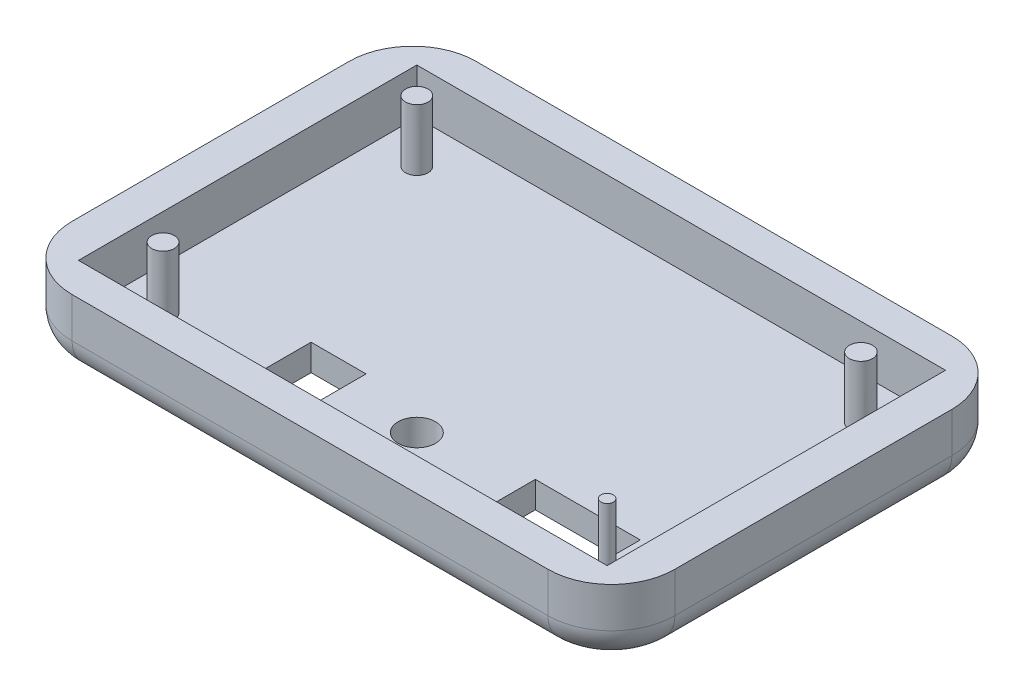
ISO-10303-21;
HEADER;
FILE_DESCRIPTION(('STEP AP214'),'2;1');
FILE_NAME('part.step','',(''),(''),'','','');
FILE_SCHEMA(('AUTOMOTIVE_DESIGN { 1 0 10303 214 1 1 1 1 }'));
ENDSEC;
DATA;
#1=APPLICATION_CONTEXT('core data for automotive mechanical design processes');
#2=APPLICATION_PROTOCOL_DEFINITION('international standard','automotive_design',2000,#1);
#3=PRODUCT_CONTEXT('',#1,'mechanical');
#4=PRODUCT('Part','Part','',(#3));
#5=PRODUCT_RELATED_PRODUCT_CATEGORY('part','',(#4));
#6=PRODUCT_DEFINITION_FORMATION('','',#4);
#7=PRODUCT_DEFINITION_CONTEXT('part definition',#1,'design');
#8=PRODUCT_DEFINITION('design','',#6,#7);
#9=PRODUCT_DEFINITION_SHAPE('','',#8);
#10=(LENGTH_UNIT() NAMED_UNIT(*) SI_UNIT(.MILLI.,.METRE.));
#11=(NAMED_UNIT(*) PLANE_ANGLE_UNIT() SI_UNIT($,.RADIAN.));
#12=(NAMED_UNIT(*) SI_UNIT($,.STERADIAN.) SOLID_ANGLE_UNIT());
#13=UNCERTAINTY_MEASURE_WITH_UNIT(LENGTH_MEASURE(1.E-05),#10,'distance_accuracy_value','');
#14=(GEOMETRIC_REPRESENTATION_CONTEXT(3) GLOBAL_UNCERTAINTY_ASSIGNED_CONTEXT((#13)) GLOBAL_UNIT_ASSIGNED_CONTEXT((#10,
#11,#12)) REPRESENTATION_CONTEXT('',''));
#15=CARTESIAN_POINT('',(0.,0.,0.));
#16=DIRECTION('',(0.,0.,1.));
#17=DIRECTION('',(1.,0.,0.));
#18=AXIS2_PLACEMENT_3D('',#15,#16,#17);
#19=CARTESIAN_POINT('',(0.,8.636,0.));
#20=DIRECTION('',(1.,0.,0.));
#21=DIRECTION('',(0.,0.,-1.));
#22=AXIS2_PLACEMENT_3D('',#19,#20,#21);
#23=PLANE('',#22);
#24=DIRECTION('',(0.,-1.,0.));
#25=VECTOR('',#24,1.);
#26=CARTESIAN_POINT('',(0.,8.636,-40.894));
#27=LINE('',#26,#25);
#28=CARTESIAN_POINT('',(0.,8.636,-40.894));
#29=VERTEX_POINT('',#28);
#30=CARTESIAN_POINT('',(0.,3.81,-40.894));
#31=VERTEX_POINT('',#30);
#32=EDGE_CURVE('E339',#29,#31,#27,.T.);
#33=ORIENTED_EDGE('',*,*,#32,.T.);
#34=DIRECTION('',(0.,0.,1.));
#35=VECTOR('',#34,1.);
#36=CARTESIAN_POINT('',(0.,3.81,-7.62));
#37=LINE('',#36,#35);
#38=CARTESIAN_POINT('',(0.,3.81,-7.62));
#39=VERTEX_POINT('',#38);
#40=EDGE_CURVE('E372',#31,#39,#37,.T.);
#41=ORIENTED_EDGE('',*,*,#40,.T.);
#42=DIRECTION('',(0.,-1.,0.));
#43=VECTOR('',#42,1.);
#44=CARTESIAN_POINT('',(0.,8.636,-7.62));
#45=LINE('',#44,#43);
#46=CARTESIAN_POINT('',(0.,8.636,-7.62));
#47=VERTEX_POINT('',#46);
#48=EDGE_CURVE('E342',#39,#47,#45,.F.);
#49=ORIENTED_EDGE('',*,*,#48,.T.);
#50=DIRECTION('',(0.,0.,1.));
#51=VECTOR('',#50,1.);
#52=CARTESIAN_POINT('',(0.,8.636,0.));
#53=LINE('',#52,#51);
#54=EDGE_CURVE('E298',#29,#47,#53,.T.);
#55=ORIENTED_EDGE('',*,*,#54,.F.);
#56=EDGE_LOOP('',(#33,#41,#49,#55));
#57=FACE_BOUND('',#56,.T.);
#58=ADVANCED_FACE('F37',(#57),#23,.F.);
#59=CARTESIAN_POINT('',(0.,8.636,0.));
#60=DIRECTION('',(0.,0.,-1.));
#61=DIRECTION('',(-1.,0.,0.));
#62=AXIS2_PLACEMENT_3D('',#59,#60,#61);
#63=PLANE('',#62);
#64=DIRECTION('',(0.,-1.,0.));
#65=VECTOR('',#64,1.);
#66=CARTESIAN_POINT('',(7.62,8.636,0.));
#67=LINE('',#66,#65);
#68=CARTESIAN_POINT('',(7.62,8.636,0.));
#69=VERTEX_POINT('',#68);
#70=CARTESIAN_POINT('',(7.62,3.81,0.));
#71=VERTEX_POINT('',#70);
#72=EDGE_CURVE('E334',#69,#71,#67,.T.);
#73=ORIENTED_EDGE('',*,*,#72,.T.);
#74=DIRECTION('',(1.,0.,0.));
#75=VECTOR('',#74,1.);
#76=CARTESIAN_POINT('',(64.77,3.81,0.));
#77=LINE('',#76,#75);
#78=CARTESIAN_POINT('',(64.77,3.81,0.));
#79=VERTEX_POINT('',#78);
#80=EDGE_CURVE('E368',#71,#79,#77,.T.);
#81=ORIENTED_EDGE('',*,*,#80,.T.);
#82=DIRECTION('',(0.,-1.,0.));
#83=VECTOR('',#82,1.);
#84=CARTESIAN_POINT('',(64.77,8.636,0.));
#85=LINE('',#84,#83);
#86=CARTESIAN_POINT('',(64.77,8.636,0.));
#87=VERTEX_POINT('',#86);
#88=EDGE_CURVE('E337',#79,#87,#85,.F.);
#89=ORIENTED_EDGE('',*,*,#88,.T.);
#90=DIRECTION('',(1.,0.,0.));
#91=VECTOR('',#90,1.);
#92=CARTESIAN_POINT('',(0.,8.636,0.));
#93=LINE('',#92,#91);
#94=EDGE_CURVE('E307',#69,#87,#93,.T.);
#95=ORIENTED_EDGE('',*,*,#94,.F.);
#96=EDGE_LOOP('',(#73,#81,#89,#95));
#97=FACE_BOUND('',#96,.T.);
#98=ADVANCED_FACE('F434',(#97),#63,.F.);
#99=CARTESIAN_POINT('',(72.39,8.636,0.));
#100=DIRECTION('',(-1.,0.,0.));
#101=DIRECTION('',(0.,0.,1.));
#102=AXIS2_PLACEMENT_3D('',#99,#100,#101);
#103=PLANE('',#102);
#104=DIRECTION('',(0.,-1.,0.));
#105=VECTOR('',#104,1.);
#106=CARTESIAN_POINT('',(72.39,8.636,-7.62));
#107=LINE('',#106,#105);
#108=CARTESIAN_POINT('',(72.39,8.636,-7.62));
#109=VERTEX_POINT('',#108);
#110=CARTESIAN_POINT('',(72.39,3.81,-7.62));
#111=VERTEX_POINT('',#110);
#112=EDGE_CURVE('E321',#109,#111,#107,.T.);
#113=ORIENTED_EDGE('',*,*,#112,.T.);
#114=DIRECTION('',(0.,0.,-1.));
#115=VECTOR('',#114,1.);
#116=CARTESIAN_POINT('',(72.39,3.81,-40.894));
#117=LINE('',#116,#115);
#118=CARTESIAN_POINT('',(72.39,3.81,-40.894));
#119=VERTEX_POINT('',#118);
#120=EDGE_CURVE('E364',#111,#119,#117,.T.);
#121=ORIENTED_EDGE('',*,*,#120,.T.);
#122=DIRECTION('',(0.,-1.,0.));
#123=VECTOR('',#122,1.);
#124=CARTESIAN_POINT('',(72.39,8.636,-40.894));
#125=LINE('',#124,#123);
#126=CARTESIAN_POINT('',(72.39,8.636,-40.894));
#127=VERTEX_POINT('',#126);
#128=EDGE_CURVE('E324',#119,#127,#125,.F.);
#129=ORIENTED_EDGE('',*,*,#128,.T.);
#130=DIRECTION('',(0.,0.,-1.));
#131=VECTOR('',#130,1.);
#132=CARTESIAN_POINT('',(72.39,8.636,0.));
#133=LINE('',#132,#131);
#134=EDGE_CURVE('E310',#109,#127,#133,.T.);
#135=ORIENTED_EDGE('',*,*,#134,.F.);
#136=EDGE_LOOP('',(#113,#121,#129,#135));
#137=FACE_BOUND('',#136,.T.);
#138=ADVANCED_FACE('F440',(#137),#103,.F.);
#139=CARTESIAN_POINT('',(0.,8.636,-48.514));
#140=DIRECTION('',(0.,0.,1.));
#141=DIRECTION('',(1.,0.,0.));
#142=AXIS2_PLACEMENT_3D('',#139,#140,#141);
#143=PLANE('',#142);
#144=DIRECTION('',(0.,-1.,0.));
#145=VECTOR('',#144,1.);
#146=CARTESIAN_POINT('',(64.77,8.636,-48.514));
#147=LINE('',#146,#145);
#148=CARTESIAN_POINT('',(64.77,8.636,-48.514));
#149=VERTEX_POINT('',#148);
#150=CARTESIAN_POINT('',(64.77,3.81,-48.514));
#151=VERTEX_POINT('',#150);
#152=EDGE_CURVE('E318',#149,#151,#147,.T.);
#153=ORIENTED_EDGE('',*,*,#152,.T.);
#154=DIRECTION('',(-1.,0.,0.));
#155=VECTOR('',#154,1.);
#156=CARTESIAN_POINT('',(7.62,3.81,-48.514));
#157=LINE('',#156,#155);
#158=CARTESIAN_POINT('',(7.62,3.81,-48.514));
#159=VERTEX_POINT('',#158);
#160=EDGE_CURVE('E376',#151,#159,#157,.T.);
#161=ORIENTED_EDGE('',*,*,#160,.T.);
#162=DIRECTION('',(0.,-1.,0.));
#163=VECTOR('',#162,1.);
#164=CARTESIAN_POINT('',(7.62,8.636,-48.514));
#165=LINE('',#164,#163);
#166=CARTESIAN_POINT('',(7.62,8.636,-48.514));
#167=VERTEX_POINT('',#166);
#168=EDGE_CURVE('E316',#159,#167,#165,.F.);
#169=ORIENTED_EDGE('',*,*,#168,.T.);
#170=DIRECTION('',(-1.,0.,0.));
#171=VECTOR('',#170,1.);
#172=CARTESIAN_POINT('',(0.,8.636,-48.514));
#173=LINE('',#172,#171);
#174=EDGE_CURVE('E313',#149,#167,#173,.T.);
#175=ORIENTED_EDGE('',*,*,#174,.F.);
#176=EDGE_LOOP('',(#153,#161,#169,#175));
#177=FACE_BOUND('',#176,.T.);
#178=ADVANCED_FACE('F526',(#177),#143,.F.);
#179=CARTESIAN_POINT('',(0.,8.636,0.));
#180=DIRECTION('',(0.,-1.,0.));
#181=DIRECTION('',(0.,0.,-1.));
#182=AXIS2_PLACEMENT_3D('',#179,#180,#181);
#183=PLANE('',#182);
#184=DIRECTION('',(-1.,0.,0.));
#185=VECTOR('',#184,1.);
#186=CARTESIAN_POINT('',(4.44499999999999,8.636,-44.577));
#187=LINE('',#186,#185);
#188=CARTESIAN_POINT('',(67.945,8.636,-44.577));
#189=VERTEX_POINT('',#188);
#190=CARTESIAN_POINT('',(4.44499999999999,8.636,-44.577));
#191=VERTEX_POINT('',#190);
#192=EDGE_CURVE('E286',#189,#191,#187,.T.);
#193=ORIENTED_EDGE('',*,*,#192,.F.);
#194=DIRECTION('',(0.,0.,-1.));
#195=VECTOR('',#194,1.);
#196=CARTESIAN_POINT('',(67.945,8.636,-3.937));
#197=LINE('',#196,#195);
#198=CARTESIAN_POINT('',(67.945,8.636,-3.937));
#199=VERTEX_POINT('',#198);
#200=EDGE_CURVE('E284',#199,#189,#197,.T.);
#201=ORIENTED_EDGE('',*,*,#200,.F.);
#202=DIRECTION('',(1.,0.,0.));
#203=VECTOR('',#202,1.);
#204=CARTESIAN_POINT('',(4.44499999999999,8.636,-3.937));
#205=LINE('',#204,#203);
#206=CARTESIAN_POINT('',(4.44499999999999,8.636,-3.937));
#207=VERTEX_POINT('',#206);
#208=EDGE_CURVE('E274',#207,#199,#205,.T.);
#209=ORIENTED_EDGE('',*,*,#208,.F.);
#210=DIRECTION('',(0.,0.,1.));
#211=VECTOR('',#210,1.);
#212=CARTESIAN_POINT('',(4.44499999999999,8.636,-3.937));
#213=LINE('',#212,#211);
#214=EDGE_CURVE('E291',#191,#207,#213,.T.);
#215=ORIENTED_EDGE('',*,*,#214,.F.);
#216=EDGE_LOOP('',(#193,#201,#209,#215));
#217=FACE_BOUND('',#216,.T.);
#218=ORIENTED_EDGE('',*,*,#134,.T.);
#219=CARTESIAN_POINT('',(64.77,8.636,-40.894));
#220=DIRECTION('',(0.,-1.,0.));
#221=DIRECTION('',(0.,0.,-1.));
#222=AXIS2_PLACEMENT_3D('',#219,#220,#221);
#223=CIRCLE('',#222,7.62);
#224=EDGE_CURVE('E332',#127,#149,#223,.F.);
#225=ORIENTED_EDGE('',*,*,#224,.T.);
#226=ORIENTED_EDGE('',*,*,#174,.T.);
#227=CARTESIAN_POINT('',(7.62,8.636,-40.894));
#228=DIRECTION('',(0.,-1.,0.));
#229=DIRECTION('',(0.,0.,-1.));
#230=AXIS2_PLACEMENT_3D('',#227,#228,#229);
#231=CIRCLE('',#230,7.62);
#232=EDGE_CURVE('E326',#167,#29,#231,.F.);
#233=ORIENTED_EDGE('',*,*,#232,.T.);
#234=ORIENTED_EDGE('',*,*,#54,.T.);
#235=CARTESIAN_POINT('',(7.62,8.636,-7.62));
#236=DIRECTION('',(0.,-1.,0.));
#237=DIRECTION('',(0.,0.,-1.));
#238=AXIS2_PLACEMENT_3D('',#235,#236,#237);
#239=CIRCLE('',#238,7.62);
#240=EDGE_CURVE('E328',#47,#69,#239,.F.);
#241=ORIENTED_EDGE('',*,*,#240,.T.);
#242=ORIENTED_EDGE('',*,*,#94,.T.);
#243=CARTESIAN_POINT('',(64.77,8.636,-7.62));
#244=DIRECTION('',(0.,-1.,0.));
#245=DIRECTION('',(0.,0.,-1.));
#246=AXIS2_PLACEMENT_3D('',#243,#244,#245);
#247=CIRCLE('',#246,7.62);
#248=EDGE_CURVE('E330',#87,#109,#247,.F.);
#249=ORIENTED_EDGE('',*,*,#248,.T.);
#250=EDGE_LOOP('',(#218,#225,#226,#233,#234,#241,#242,#249));
#251=FACE_BOUND('',#250,.T.);
#252=ADVANCED_FACE('F506',(#217,#251),#183,.F.);
#253=CARTESIAN_POINT('',(0.,0.,0.));
#254=DIRECTION('',(0.,-1.,0.));
#255=DIRECTION('',(0.,0.,-1.));
#256=AXIS2_PLACEMENT_3D('',#253,#254,#255);
#257=PLANE('',#256);
#258=DIRECTION('',(0.,0.,-1.));
#259=VECTOR('',#258,1.);
#260=CARTESIAN_POINT('',(49.199,0.,0.));
#261=LINE('',#260,#259);
#262=CARTESIAN_POINT('',(49.199,0.,-9.05699999999999));
#263=VERTEX_POINT('',#262);
#264=CARTESIAN_POINT('',(49.199,0.,-14.057));
#265=VERTEX_POINT('',#264);
#266=EDGE_CURVE('E261',#263,#265,#261,.T.);
#267=ORIENTED_EDGE('',*,*,#266,.F.);
#268=DIRECTION('',(-1.,0.,0.));
#269=VECTOR('',#268,1.);
#270=CARTESIAN_POINT('',(0.,0.,-9.05699999999999));
#271=LINE('',#270,#269);
#272=CARTESIAN_POINT('',(61.799,0.,-9.057));
#273=VERTEX_POINT('',#272);
#274=EDGE_CURVE('E256',#273,#263,#271,.T.);
#275=ORIENTED_EDGE('',*,*,#274,.F.);
#276=DIRECTION('',(0.,0.,1.));
#277=VECTOR('',#276,1.);
#278=CARTESIAN_POINT('',(61.799,0.,0.));
#279=LINE('',#278,#277);
#280=CARTESIAN_POINT('',(61.799,0.,-14.057));
#281=VERTEX_POINT('',#280);
#282=EDGE_CURVE('E203',#281,#273,#279,.T.);
#283=ORIENTED_EDGE('',*,*,#282,.F.);
#284=DIRECTION('',(1.,0.,0.));
#285=VECTOR('',#284,1.);
#286=CARTESIAN_POINT('',(0.,0.,-14.057));
#287=LINE('',#286,#285);
#288=EDGE_CURVE('E259',#265,#281,#287,.T.);
#289=ORIENTED_EDGE('',*,*,#288,.F.);
#290=EDGE_LOOP('',(#267,#275,#283,#289));
#291=FACE_BOUND('',#290,.T.);
#292=DIRECTION('',(0.,0.,-1.));
#293=VECTOR('',#292,1.);
#294=CARTESIAN_POINT('',(21.463,0.,0.));
#295=LINE('',#294,#293);
#296=CARTESIAN_POINT('',(21.463,0.,-8.25499999999999));
#297=VERTEX_POINT('',#296);
#298=CARTESIAN_POINT('',(21.463,0.,-14.859));
#299=VERTEX_POINT('',#298);
#300=EDGE_CURVE('E254',#297,#299,#295,.T.);
#301=ORIENTED_EDGE('',*,*,#300,.F.);
#302=DIRECTION('',(-1.,0.,0.));
#303=VECTOR('',#302,1.);
#304=CARTESIAN_POINT('',(0.,0.,-8.25499999999999));
#305=LINE('',#304,#303);
#306=CARTESIAN_POINT('',(28.067,0.,-8.255));
#307=VERTEX_POINT('',#306);
#308=EDGE_CURVE('E227',#307,#297,#305,.T.);
#309=ORIENTED_EDGE('',*,*,#308,.F.);
#310=DIRECTION('',(0.,0.,1.));
#311=VECTOR('',#310,1.);
#312=CARTESIAN_POINT('',(28.067,0.,0.));
#313=LINE('',#312,#311);
#314=CARTESIAN_POINT('',(28.067,0.,-14.859));
#315=VERTEX_POINT('',#314);
#316=EDGE_CURVE('E250',#315,#307,#313,.T.);
#317=ORIENTED_EDGE('',*,*,#316,.F.);
#318=DIRECTION('',(1.,0.,0.));
#319=VECTOR('',#318,1.);
#320=CARTESIAN_POINT('',(0.,0.,-14.859));
#321=LINE('',#320,#319);
#322=EDGE_CURVE('E252',#299,#315,#321,.T.);
#323=ORIENTED_EDGE('',*,*,#322,.F.);
#324=EDGE_LOOP('',(#301,#309,#317,#323));
#325=FACE_BOUND('',#324,.T.);
#326=CARTESIAN_POINT('',(37.211,0.,-11.811));
#327=DIRECTION('',(0.,-1.,0.));
#328=DIRECTION('',(0.,0.,-1.));
#329=AXIS2_PLACEMENT_3D('',#326,#327,#328);
#330=CIRCLE('',#329,2.25);
#331=CARTESIAN_POINT('',(37.211,0.,-14.061));
#332=VERTEX_POINT('',#331);
#333=EDGE_CURVE('E266',#332,#332,#330,.T.);
#334=ORIENTED_EDGE('',*,*,#333,.F.);
#335=EDGE_LOOP('',(#334));
#336=FACE_BOUND('',#335,.T.);
#337=DIRECTION('',(-1.,0.,0.));
#338=VECTOR('',#337,1.);
#339=CARTESIAN_POINT('',(64.77,0.,-44.704));
#340=LINE('',#339,#338);
#341=CARTESIAN_POINT('',(7.62,0.,-44.704));
#342=VERTEX_POINT('',#341);
#343=CARTESIAN_POINT('',(64.77,0.,-44.704));
#344=VERTEX_POINT('',#343);
#345=EDGE_CURVE('E344',#342,#344,#340,.F.);
#346=ORIENTED_EDGE('',*,*,#345,.T.);
#347=CARTESIAN_POINT('',(64.77,0.,-40.894));
#348=DIRECTION('',(0.,-1.,0.));
#349=DIRECTION('',(0.,0.,-1.));
#350=AXIS2_PLACEMENT_3D('',#347,#348,#349);
#351=CIRCLE('',#350,3.81);
#352=CARTESIAN_POINT('',(68.58,0.,-40.894));
#353=VERTEX_POINT('',#352);
#354=EDGE_CURVE('E358',#344,#353,#351,.T.);
#355=ORIENTED_EDGE('',*,*,#354,.T.);
#356=DIRECTION('',(0.,0.,-1.));
#357=VECTOR('',#356,1.);
#358=CARTESIAN_POINT('',(68.58,0.,-7.62));
#359=LINE('',#358,#357);
#360=CARTESIAN_POINT('',(68.58,0.,-7.62));
#361=VERTEX_POINT('',#360);
#362=EDGE_CURVE('E356',#353,#361,#359,.F.);
#363=ORIENTED_EDGE('',*,*,#362,.T.);
#364=CARTESIAN_POINT('',(64.77,0.,-7.62));
#365=DIRECTION('',(0.,-1.,0.));
#366=DIRECTION('',(0.,0.,-1.));
#367=AXIS2_PLACEMENT_3D('',#364,#365,#366);
#368=CIRCLE('',#367,3.81);
#369=CARTESIAN_POINT('',(64.77,0.,-3.81));
#370=VERTEX_POINT('',#369);
#371=EDGE_CURVE('E354',#361,#370,#368,.T.);
#372=ORIENTED_EDGE('',*,*,#371,.T.);
#373=DIRECTION('',(1.,0.,0.));
#374=VECTOR('',#373,1.);
#375=CARTESIAN_POINT('',(7.62,0.,-3.81));
#376=LINE('',#375,#374);
#377=CARTESIAN_POINT('',(7.62,0.,-3.81));
#378=VERTEX_POINT('',#377);
#379=EDGE_CURVE('E352',#370,#378,#376,.F.);
#380=ORIENTED_EDGE('',*,*,#379,.T.);
#381=CARTESIAN_POINT('',(7.62,0.,-7.62));
#382=DIRECTION('',(0.,-1.,0.));
#383=DIRECTION('',(0.,0.,-1.));
#384=AXIS2_PLACEMENT_3D('',#381,#382,#383);
#385=CIRCLE('',#384,3.81);
#386=CARTESIAN_POINT('',(3.81,0.,-7.62));
#387=VERTEX_POINT('',#386);
#388=EDGE_CURVE('E350',#378,#387,#385,.T.);
#389=ORIENTED_EDGE('',*,*,#388,.T.);
#390=DIRECTION('',(0.,0.,1.));
#391=VECTOR('',#390,1.);
#392=CARTESIAN_POINT('',(3.81,0.,-40.894));
#393=LINE('',#392,#391);
#394=CARTESIAN_POINT('',(3.81,0.,-40.894));
#395=VERTEX_POINT('',#394);
#396=EDGE_CURVE('E348',#387,#395,#393,.F.);
#397=ORIENTED_EDGE('',*,*,#396,.T.);
#398=CARTESIAN_POINT('',(7.62,0.,-40.894));
#399=DIRECTION('',(0.,-1.,0.));
#400=DIRECTION('',(0.,0.,-1.));
#401=AXIS2_PLACEMENT_3D('',#398,#399,#400);
#402=CIRCLE('',#401,3.81);
#403=EDGE_CURVE('E346',#395,#342,#402,.T.);
#404=ORIENTED_EDGE('',*,*,#403,.T.);
#405=EDGE_LOOP('',(#346,#355,#363,#372,#380,#389,#397,#404));
#406=FACE_BOUND('',#405,.T.);
#407=ADVANCED_FACE('F536',(#291,#325,#336,#406),#257,.T.);
#408=CARTESIAN_POINT('',(67.945,3.175,-3.937));
#409=DIRECTION('',(1.,0.,0.));
#410=DIRECTION('',(0.,0.,-1.));
#411=AXIS2_PLACEMENT_3D('',#408,#409,#410);
#412=PLANE('',#411);
#413=ORIENTED_EDGE('',*,*,#200,.T.);
#414=DIRECTION('',(0.,1.,0.));
#415=VECTOR('',#414,1.);
#416=CARTESIAN_POINT('',(67.945,3.175,-44.577));
#417=LINE('',#416,#415);
#418=CARTESIAN_POINT('',(67.945,3.175,-44.577));
#419=VERTEX_POINT('',#418);
#420=EDGE_CURVE('E283',#419,#189,#417,.T.);
#421=ORIENTED_EDGE('',*,*,#420,.F.);
#422=DIRECTION('',(0.,0.,-1.));
#423=VECTOR('',#422,1.);
#424=CARTESIAN_POINT('',(67.945,3.175,-3.937));
#425=LINE('',#424,#423);
#426=CARTESIAN_POINT('',(67.945,3.175,-3.937));
#427=VERTEX_POINT('',#426);
#428=EDGE_CURVE('E270',#427,#419,#425,.T.);
#429=ORIENTED_EDGE('',*,*,#428,.F.);
#430=DIRECTION('',(0.,1.,0.));
#431=VECTOR('',#430,1.);
#432=CARTESIAN_POINT('',(67.945,3.175,-3.937));
#433=LINE('',#432,#431);
#434=EDGE_CURVE('E296',#427,#199,#433,.T.);
#435=ORIENTED_EDGE('',*,*,#434,.T.);
#436=EDGE_LOOP('',(#413,#421,#429,#435));
#437=FACE_BOUND('',#436,.T.);
#438=ADVANCED_FACE('F539',(#437),#412,.F.);
#439=CARTESIAN_POINT('',(4.44499999999999,3.175,-3.937));
#440=DIRECTION('',(0.,0.,1.));
#441=DIRECTION('',(1.,0.,0.));
#442=AXIS2_PLACEMENT_3D('',#439,#440,#441);
#443=PLANE('',#442);
#444=ORIENTED_EDGE('',*,*,#208,.T.);
#445=ORIENTED_EDGE('',*,*,#434,.F.);
#446=DIRECTION('',(1.,0.,0.));
#447=VECTOR('',#446,1.);
#448=CARTESIAN_POINT('',(4.44499999999999,3.175,-3.937));
#449=LINE('',#448,#447);
#450=CARTESIAN_POINT('',(4.44499999999999,3.175,-3.937));
#451=VERTEX_POINT('',#450);
#452=EDGE_CURVE('E280',#451,#427,#449,.T.);
#453=ORIENTED_EDGE('',*,*,#452,.F.);
#454=DIRECTION('',(0.,1.,0.));
#455=VECTOR('',#454,1.);
#456=CARTESIAN_POINT('',(4.44499999999999,3.175,-3.937));
#457=LINE('',#456,#455);
#458=EDGE_CURVE('E299',#451,#207,#457,.T.);
#459=ORIENTED_EDGE('',*,*,#458,.T.);
#460=EDGE_LOOP('',(#444,#445,#453,#459));
#461=FACE_BOUND('',#460,.T.);
#462=ADVANCED_FACE('F546',(#461),#443,.F.);
#463=CARTESIAN_POINT('',(4.44499999999999,3.175,-3.937));
#464=DIRECTION('',(-1.,0.,0.));
#465=DIRECTION('',(0.,0.,1.));
#466=AXIS2_PLACEMENT_3D('',#463,#464,#465);
#467=PLANE('',#466);
#468=ORIENTED_EDGE('',*,*,#214,.T.);
#469=ORIENTED_EDGE('',*,*,#458,.F.);
#470=DIRECTION('',(0.,0.,1.));
#471=VECTOR('',#470,1.);
#472=CARTESIAN_POINT('',(4.44499999999999,3.175,-3.937));
#473=LINE('',#472,#471);
#474=CARTESIAN_POINT('',(4.44499999999999,3.175,-44.577));
#475=VERTEX_POINT('',#474);
#476=EDGE_CURVE('E277',#475,#451,#473,.T.);
#477=ORIENTED_EDGE('',*,*,#476,.F.);
#478=DIRECTION('',(0.,1.,0.));
#479=VECTOR('',#478,1.);
#480=CARTESIAN_POINT('',(4.44499999999999,3.175,-44.577));
#481=LINE('',#480,#479);
#482=EDGE_CURVE('E301',#475,#191,#481,.T.);
#483=ORIENTED_EDGE('',*,*,#482,.T.);
#484=EDGE_LOOP('',(#468,#469,#477,#483));
#485=FACE_BOUND('',#484,.T.);
#486=ADVANCED_FACE('F591',(#485),#467,.F.);
#487=CARTESIAN_POINT('',(4.44499999999999,3.175,-44.577));
#488=DIRECTION('',(0.,0.,-1.));
#489=DIRECTION('',(-1.,0.,0.));
#490=AXIS2_PLACEMENT_3D('',#487,#488,#489);
#491=PLANE('',#490);
#492=ORIENTED_EDGE('',*,*,#192,.T.);
#493=ORIENTED_EDGE('',*,*,#482,.F.);
#494=DIRECTION('',(-1.,0.,0.));
#495=VECTOR('',#494,1.);
#496=CARTESIAN_POINT('',(4.44499999999999,3.175,-44.577));
#497=LINE('',#496,#495);
#498=EDGE_CURVE('E273',#419,#475,#497,.T.);
#499=ORIENTED_EDGE('',*,*,#498,.F.);
#500=ORIENTED_EDGE('',*,*,#420,.T.);
#501=EDGE_LOOP('',(#492,#493,#499,#500));
#502=FACE_BOUND('',#501,.T.);
#503=ADVANCED_FACE('F411',(#502),#491,.F.);
#504=CARTESIAN_POINT('',(0.,3.175,0.));
#505=DIRECTION('',(0.,-1.,0.));
#506=DIRECTION('',(0.,0.,-1.));
#507=AXIS2_PLACEMENT_3D('',#504,#505,#506);
#508=PLANE('',#507);
#509=CARTESIAN_POINT('',(62.865,3.175,-9.017));
#510=DIRECTION('',(0.,-1.,0.));
#511=DIRECTION('',(0.,0.,-1.));
#512=AXIS2_PLACEMENT_3D('',#509,#510,#511);
#513=CIRCLE('',#512,0.749999999999999);
#514=CARTESIAN_POINT('',(62.865,3.175,-9.767));
#515=VERTEX_POINT('',#514);
#516=EDGE_CURVE('E11',#515,#515,#513,.F.);
#517=ORIENTED_EDGE('',*,*,#516,.F.);
#518=EDGE_LOOP('',(#517));
#519=FACE_BOUND('',#518,.T.);
#520=CARTESIAN_POINT('',(62.865,3.175,-39.497));
#521=DIRECTION('',(0.,-1.,0.));
#522=DIRECTION('',(0.,0.,-1.));
#523=AXIS2_PLACEMENT_3D('',#520,#521,#522);
#524=CIRCLE('',#523,1.385);
#525=CARTESIAN_POINT('',(62.865,3.175,-40.882));
#526=VERTEX_POINT('',#525);
#527=EDGE_CURVE('E45',#526,#526,#524,.F.);
#528=ORIENTED_EDGE('',*,*,#527,.F.);
#529=EDGE_LOOP('',(#528));
#530=FACE_BOUND('',#529,.T.);
#531=CARTESIAN_POINT('',(9.52499999999999,3.175,-9.017));
#532=DIRECTION('',(0.,-1.,0.));
#533=DIRECTION('',(0.,0.,-1.));
#534=AXIS2_PLACEMENT_3D('',#531,#532,#533);
#535=CIRCLE('',#534,1.3499973);
#536=CARTESIAN_POINT('',(9.52499999999999,3.175,-10.3669973));
#537=VERTEX_POINT('',#536);
#538=EDGE_CURVE('E401',#537,#537,#535,.F.);
#539=ORIENTED_EDGE('',*,*,#538,.F.);
#540=EDGE_LOOP('',(#539));
#541=FACE_BOUND('',#540,.T.);
#542=CARTESIAN_POINT('',(9.52499999999999,3.175,-39.497));
#543=DIRECTION('',(0.,-1.,0.));
#544=DIRECTION('',(0.,0.,-1.));
#545=AXIS2_PLACEMENT_3D('',#542,#543,#544);
#546=CIRCLE('',#545,1.35);
#547=CARTESIAN_POINT('',(9.52499999999999,3.175,-40.847));
#548=VERTEX_POINT('',#547);
#549=EDGE_CURVE('E378',#548,#548,#546,.F.);
#550=ORIENTED_EDGE('',*,*,#549,.F.);
#551=EDGE_LOOP('',(#550));
#552=FACE_BOUND('',#551,.T.);
#553=DIRECTION('',(1.,0.,0.));
#554=VECTOR('',#553,1.);
#555=CARTESIAN_POINT('',(61.799,3.175,-9.057));
#556=LINE('',#555,#554);
#557=CARTESIAN_POINT('',(49.199,3.175,-9.05699999999999));
#558=VERTEX_POINT('',#557);
#559=CARTESIAN_POINT('',(61.799,3.175,-9.057));
#560=VERTEX_POINT('',#559);
#561=EDGE_CURVE('E210',#558,#560,#556,.T.);
#562=ORIENTED_EDGE('',*,*,#561,.F.);
#563=DIRECTION('',(0.,0.,1.));
#564=VECTOR('',#563,1.);
#565=CARTESIAN_POINT('',(49.199,3.175,-14.057));
#566=LINE('',#565,#564);
#567=CARTESIAN_POINT('',(49.199,3.175,-14.057));
#568=VERTEX_POINT('',#567);
#569=EDGE_CURVE('E215',#568,#558,#566,.T.);
#570=ORIENTED_EDGE('',*,*,#569,.F.);
#571=DIRECTION('',(-1.,0.,0.));
#572=VECTOR('',#571,1.);
#573=CARTESIAN_POINT('',(61.799,3.175,-14.057));
#574=LINE('',#573,#572);
#575=CARTESIAN_POINT('',(61.799,3.175,-14.057));
#576=VERTEX_POINT('',#575);
#577=EDGE_CURVE('E220',#576,#568,#574,.T.);
#578=ORIENTED_EDGE('',*,*,#577,.F.);
#579=DIRECTION('',(0.,0.,-1.));
#580=VECTOR('',#579,1.);
#581=CARTESIAN_POINT('',(61.799,3.175,-14.057));
#582=LINE('',#581,#580);
#583=EDGE_CURVE('E200',#560,#576,#582,.T.);
#584=ORIENTED_EDGE('',*,*,#583,.F.);
#585=EDGE_LOOP('',(#562,#570,#578,#584));
#586=FACE_BOUND('',#585,.T.);
#587=DIRECTION('',(1.,0.,0.));
#588=VECTOR('',#587,1.);
#589=CARTESIAN_POINT('',(28.067,3.175,-8.255));
#590=LINE('',#589,#588);
#591=CARTESIAN_POINT('',(21.463,3.175,-8.25499999999999));
#592=VERTEX_POINT('',#591);
#593=CARTESIAN_POINT('',(28.067,3.175,-8.255));
#594=VERTEX_POINT('',#593);
#595=EDGE_CURVE('E232',#592,#594,#590,.T.);
#596=ORIENTED_EDGE('',*,*,#595,.F.);
#597=DIRECTION('',(0.,0.,1.));
#598=VECTOR('',#597,1.);
#599=CARTESIAN_POINT('',(21.463,3.175,-14.859));
#600=LINE('',#599,#598);
#601=CARTESIAN_POINT('',(21.463,3.175,-14.859));
#602=VERTEX_POINT('',#601);
#603=EDGE_CURVE('E230',#602,#592,#600,.T.);
#604=ORIENTED_EDGE('',*,*,#603,.F.);
#605=DIRECTION('',(-1.,0.,0.));
#606=VECTOR('',#605,1.);
#607=CARTESIAN_POINT('',(28.067,3.175,-14.859));
#608=LINE('',#607,#606);
#609=CARTESIAN_POINT('',(28.067,3.175,-14.859));
#610=VERTEX_POINT('',#609);
#611=EDGE_CURVE('E238',#610,#602,#608,.T.);
#612=ORIENTED_EDGE('',*,*,#611,.F.);
#613=DIRECTION('',(0.,0.,-1.));
#614=VECTOR('',#613,1.);
#615=CARTESIAN_POINT('',(28.067,3.175,-14.859));
#616=LINE('',#615,#614);
#617=EDGE_CURVE('E235',#594,#610,#616,.T.);
#618=ORIENTED_EDGE('',*,*,#617,.F.);
#619=EDGE_LOOP('',(#596,#604,#612,#618));
#620=FACE_BOUND('',#619,.T.);
#621=CARTESIAN_POINT('',(37.211,3.175,-11.811));
#622=DIRECTION('',(0.,1.,0.));
#623=DIRECTION('',(0.,0.,1.));
#624=AXIS2_PLACEMENT_3D('',#621,#622,#623);
#625=CIRCLE('',#624,2.25);
#626=CARTESIAN_POINT('',(37.211,3.175,-9.56099999999999));
#627=VERTEX_POINT('',#626);
#628=EDGE_CURVE('E263',#627,#627,#625,.T.);
#629=ORIENTED_EDGE('',*,*,#628,.F.);
#630=EDGE_LOOP('',(#629));
#631=FACE_BOUND('',#630,.T.);
#632=ORIENTED_EDGE('',*,*,#428,.T.);
#633=ORIENTED_EDGE('',*,*,#498,.T.);
#634=ORIENTED_EDGE('',*,*,#476,.T.);
#635=ORIENTED_EDGE('',*,*,#452,.T.);
#636=EDGE_LOOP('',(#632,#633,#634,#635));
#637=FACE_BOUND('',#636,.T.);
#638=ADVANCED_FACE('F217',(#519,#530,#541,#552,#586,#620,#631,#637),#508,.F.);
#639=CARTESIAN_POINT('',(64.77,8.636,-40.894));
#640=DIRECTION('',(0.,-1.,0.));
#641=DIRECTION('',(0.,0.,-1.));
#642=AXIS2_PLACEMENT_3D('',#639,#640,#641);
#643=CYLINDRICAL_SURFACE('',#642,7.62);
#644=ORIENTED_EDGE('',*,*,#128,.F.);
#645=CARTESIAN_POINT('',(64.77,3.81,-40.894));
#646=DIRECTION('',(0.,-1.,0.));
#647=DIRECTION('',(0.,0.,-1.));
#648=AXIS2_PLACEMENT_3D('',#645,#646,#647);
#649=CIRCLE('',#648,7.62);
#650=EDGE_CURVE('E361',#119,#151,#649,.F.);
#651=ORIENTED_EDGE('',*,*,#650,.T.);
#652=ORIENTED_EDGE('',*,*,#152,.F.);
#653=ORIENTED_EDGE('',*,*,#224,.F.);
#654=EDGE_LOOP('',(#644,#651,#652,#653));
#655=FACE_BOUND('',#654,.T.);
#656=ADVANCED_FACE('F410',(#655),#643,.T.);
#657=CARTESIAN_POINT('',(64.77,8.636,-7.62));
#658=DIRECTION('',(0.,-1.,0.));
#659=DIRECTION('',(0.,0.,-1.));
#660=AXIS2_PLACEMENT_3D('',#657,#658,#659);
#661=CYLINDRICAL_SURFACE('',#660,7.62);
#662=ORIENTED_EDGE('',*,*,#88,.F.);
#663=CARTESIAN_POINT('',(64.77,3.81,-7.62));
#664=DIRECTION('',(0.,-1.,0.));
#665=DIRECTION('',(0.,0.,-1.));
#666=AXIS2_PLACEMENT_3D('',#663,#664,#665);
#667=CIRCLE('',#666,7.62);
#668=EDGE_CURVE('E366',#79,#111,#667,.F.);
#669=ORIENTED_EDGE('',*,*,#668,.T.);
#670=ORIENTED_EDGE('',*,*,#112,.F.);
#671=ORIENTED_EDGE('',*,*,#248,.F.);
#672=EDGE_LOOP('',(#662,#669,#670,#671));
#673=FACE_BOUND('',#672,.T.);
#674=ADVANCED_FACE('F447',(#673),#661,.T.);
#675=CARTESIAN_POINT('',(7.62,8.636,-7.62));
#676=DIRECTION('',(0.,-1.,0.));
#677=DIRECTION('',(0.,0.,-1.));
#678=AXIS2_PLACEMENT_3D('',#675,#676,#677);
#679=CYLINDRICAL_SURFACE('',#678,7.62);
#680=ORIENTED_EDGE('',*,*,#48,.F.);
#681=CARTESIAN_POINT('',(7.62,3.81,-7.62));
#682=DIRECTION('',(0.,-1.,0.));
#683=DIRECTION('',(0.,0.,-1.));
#684=AXIS2_PLACEMENT_3D('',#681,#682,#683);
#685=CIRCLE('',#684,7.62);
#686=EDGE_CURVE('E370',#39,#71,#685,.F.);
#687=ORIENTED_EDGE('',*,*,#686,.T.);
#688=ORIENTED_EDGE('',*,*,#72,.F.);
#689=ORIENTED_EDGE('',*,*,#240,.F.);
#690=EDGE_LOOP('',(#680,#687,#688,#689));
#691=FACE_BOUND('',#690,.T.);
#692=ADVANCED_FACE('F451',(#691),#679,.T.);
#693=CARTESIAN_POINT('',(7.62,8.636,-40.894));
#694=DIRECTION('',(0.,-1.,0.));
#695=DIRECTION('',(0.,0.,-1.));
#696=AXIS2_PLACEMENT_3D('',#693,#694,#695);
#697=CYLINDRICAL_SURFACE('',#696,7.62);
#698=ORIENTED_EDGE('',*,*,#168,.F.);
#699=CARTESIAN_POINT('',(7.62,3.81,-40.894));
#700=DIRECTION('',(0.,-1.,0.));
#701=DIRECTION('',(0.,0.,-1.));
#702=AXIS2_PLACEMENT_3D('',#699,#700,#701);
#703=CIRCLE('',#702,7.62);
#704=EDGE_CURVE('E374',#159,#31,#703,.F.);
#705=ORIENTED_EDGE('',*,*,#704,.T.);
#706=ORIENTED_EDGE('',*,*,#32,.F.);
#707=ORIENTED_EDGE('',*,*,#232,.F.);
#708=EDGE_LOOP('',(#698,#705,#706,#707));
#709=FACE_BOUND('',#708,.T.);
#710=ADVANCED_FACE('F455',(#709),#697,.T.);
#711=CARTESIAN_POINT('',(7.62,3.81,-7.62));
#712=DIRECTION('',(0.,-1.,0.));
#713=DIRECTION('',(0.,0.,-1.));
#714=AXIS2_PLACEMENT_3D('',#711,#712,#713);
#715=DEGENERATE_TOROIDAL_SURFACE('',#714,3.81,3.81,.T.);
#716=CARTESIAN_POINT('',(7.62,3.81,-3.81));
#717=DIRECTION('',(1.,0.,0.));
#718=DIRECTION('',(0.,0.,-1.));
#719=AXIS2_PLACEMENT_3D('',#716,#717,#718);
#720=CIRCLE('',#719,3.81);
#721=EDGE_CURVE('E394',#71,#378,#720,.T.);
#722=ORIENTED_EDGE('',*,*,#721,.F.);
#723=ORIENTED_EDGE('',*,*,#686,.F.);
#724=CARTESIAN_POINT('',(3.81,3.81,-7.62));
#725=DIRECTION('',(0.,0.,-1.));
#726=DIRECTION('',(-1.,0.,0.));
#727=AXIS2_PLACEMENT_3D('',#724,#725,#726);
#728=CIRCLE('',#727,3.81);
#729=EDGE_CURVE('E287',#387,#39,#728,.T.);
#730=ORIENTED_EDGE('',*,*,#729,.F.);
#731=ORIENTED_EDGE('',*,*,#388,.F.);
#732=EDGE_LOOP('',(#722,#723,#730,#731));
#733=FACE_BOUND('',#732,.T.);
#734=ADVANCED_FACE('F39',(#733),#715,.T.);
#735=CARTESIAN_POINT('',(3.81,3.81,0.));
#736=DIRECTION('',(0.,0.,-1.));
#737=DIRECTION('',(-1.,0.,0.));
#738=AXIS2_PLACEMENT_3D('',#735,#736,#737);
#739=CYLINDRICAL_SURFACE('',#738,3.81);
#740=ORIENTED_EDGE('',*,*,#729,.T.);
#741=ORIENTED_EDGE('',*,*,#40,.F.);
#742=CARTESIAN_POINT('',(3.81,3.81,-40.894));
#743=DIRECTION('',(0.,0.,-1.));
#744=DIRECTION('',(-1.,0.,0.));
#745=AXIS2_PLACEMENT_3D('',#742,#743,#744);
#746=CIRCLE('',#745,3.81);
#747=EDGE_CURVE('E391',#395,#31,#746,.T.);
#748=ORIENTED_EDGE('',*,*,#747,.F.);
#749=ORIENTED_EDGE('',*,*,#396,.F.);
#750=EDGE_LOOP('',(#740,#741,#748,#749));
#751=FACE_BOUND('',#750,.T.);
#752=ADVANCED_FACE('F483',(#751),#739,.T.);
#753=CARTESIAN_POINT('',(0.,3.81,-3.81));
#754=DIRECTION('',(-1.,0.,0.));
#755=DIRECTION('',(0.,0.,1.));
#756=AXIS2_PLACEMENT_3D('',#753,#754,#755);
#757=CYLINDRICAL_SURFACE('',#756,3.81);
#758=ORIENTED_EDGE('',*,*,#721,.T.);
#759=ORIENTED_EDGE('',*,*,#379,.F.);
#760=CARTESIAN_POINT('',(64.77,3.81,-3.81));
#761=DIRECTION('',(1.,0.,0.));
#762=DIRECTION('',(0.,0.,-1.));
#763=AXIS2_PLACEMENT_3D('',#760,#761,#762);
#764=CIRCLE('',#763,3.81);
#765=EDGE_CURVE('E388',#79,#370,#764,.T.);
#766=ORIENTED_EDGE('',*,*,#765,.F.);
#767=ORIENTED_EDGE('',*,*,#80,.F.);
#768=EDGE_LOOP('',(#758,#759,#766,#767));
#769=FACE_BOUND('',#768,.T.);
#770=ADVANCED_FACE('F480',(#769),#757,.T.);
#771=CARTESIAN_POINT('',(7.62,3.81,-40.894));
#772=DIRECTION('',(0.,-1.,0.));
#773=DIRECTION('',(0.,0.,-1.));
#774=AXIS2_PLACEMENT_3D('',#771,#772,#773);
#775=DEGENERATE_TOROIDAL_SURFACE('',#774,3.81,3.81,.T.);
#776=ORIENTED_EDGE('',*,*,#747,.T.);
#777=ORIENTED_EDGE('',*,*,#704,.F.);
#778=CARTESIAN_POINT('',(7.62,3.81,-44.704));
#779=DIRECTION('',(1.,0.,0.));
#780=DIRECTION('',(0.,0.,-1.));
#781=AXIS2_PLACEMENT_3D('',#778,#779,#780);
#782=CIRCLE('',#781,3.81);
#783=EDGE_CURVE('E385',#342,#159,#782,.T.);
#784=ORIENTED_EDGE('',*,*,#783,.F.);
#785=ORIENTED_EDGE('',*,*,#403,.F.);
#786=EDGE_LOOP('',(#776,#777,#784,#785));
#787=FACE_BOUND('',#786,.T.);
#788=ADVANCED_FACE('F476',(#787),#775,.T.);
#789=CARTESIAN_POINT('',(64.77,3.81,-7.62));
#790=DIRECTION('',(0.,-1.,0.));
#791=DIRECTION('',(0.,0.,-1.));
#792=AXIS2_PLACEMENT_3D('',#789,#790,#791);
#793=DEGENERATE_TOROIDAL_SURFACE('',#792,3.81,3.81,.T.);
#794=ORIENTED_EDGE('',*,*,#765,.T.);
#795=ORIENTED_EDGE('',*,*,#371,.F.);
#796=CARTESIAN_POINT('',(68.58,3.81,-7.62));
#797=DIRECTION('',(0.,0.,-1.));
#798=DIRECTION('',(-1.,0.,0.));
#799=AXIS2_PLACEMENT_3D('',#796,#797,#798);
#800=CIRCLE('',#799,3.81);
#801=EDGE_CURVE('E382',#111,#361,#800,.T.);
#802=ORIENTED_EDGE('',*,*,#801,.F.);
#803=ORIENTED_EDGE('',*,*,#668,.F.);
#804=EDGE_LOOP('',(#794,#795,#802,#803));
#805=FACE_BOUND('',#804,.T.);
#806=ADVANCED_FACE('F472',(#805),#793,.T.);
#807=CARTESIAN_POINT('',(0.,3.81,-44.704));
#808=DIRECTION('',(1.,0.,0.));
#809=DIRECTION('',(0.,0.,-1.));
#810=AXIS2_PLACEMENT_3D('',#807,#808,#809);
#811=CYLINDRICAL_SURFACE('',#810,3.81);
#812=ORIENTED_EDGE('',*,*,#783,.T.);
#813=ORIENTED_EDGE('',*,*,#160,.F.);
#814=CARTESIAN_POINT('',(64.77,3.81,-44.704));
#815=DIRECTION('',(1.,0.,0.));
#816=DIRECTION('',(0.,0.,-1.));
#817=AXIS2_PLACEMENT_3D('',#814,#815,#816);
#818=CIRCLE('',#817,3.81);
#819=EDGE_CURVE('E380',#344,#151,#818,.T.);
#820=ORIENTED_EDGE('',*,*,#819,.F.);
#821=ORIENTED_EDGE('',*,*,#345,.F.);
#822=EDGE_LOOP('',(#812,#813,#820,#821));
#823=FACE_BOUND('',#822,.T.);
#824=ADVANCED_FACE('F468',(#823),#811,.T.);
#825=CARTESIAN_POINT('',(68.58,3.81,0.));
#826=DIRECTION('',(0.,0.,1.));
#827=DIRECTION('',(1.,0.,0.));
#828=AXIS2_PLACEMENT_3D('',#825,#826,#827);
#829=CYLINDRICAL_SURFACE('',#828,3.81);
#830=ORIENTED_EDGE('',*,*,#801,.T.);
#831=ORIENTED_EDGE('',*,*,#362,.F.);
#832=CARTESIAN_POINT('',(68.58,3.81,-40.894));
#833=DIRECTION('',(0.,0.,-1.));
#834=DIRECTION('',(-1.,0.,0.));
#835=AXIS2_PLACEMENT_3D('',#832,#833,#834);
#836=CIRCLE('',#835,3.81);
#837=EDGE_CURVE('E269',#119,#353,#836,.T.);
#838=ORIENTED_EDGE('',*,*,#837,.F.);
#839=ORIENTED_EDGE('',*,*,#120,.F.);
#840=EDGE_LOOP('',(#830,#831,#838,#839));
#841=FACE_BOUND('',#840,.T.);
#842=ADVANCED_FACE('F464',(#841),#829,.T.);
#843=CARTESIAN_POINT('',(64.77,3.81,-40.894));
#844=DIRECTION('',(0.,-1.,0.));
#845=DIRECTION('',(0.,0.,-1.));
#846=AXIS2_PLACEMENT_3D('',#843,#844,#845);
#847=DEGENERATE_TOROIDAL_SURFACE('',#846,3.81,3.81,.T.);
#848=ORIENTED_EDGE('',*,*,#819,.T.);
#849=ORIENTED_EDGE('',*,*,#650,.F.);
#850=ORIENTED_EDGE('',*,*,#837,.T.);
#851=ORIENTED_EDGE('',*,*,#354,.F.);
#852=EDGE_LOOP('',(#848,#849,#850,#851));
#853=FACE_BOUND('',#852,.T.);
#854=ADVANCED_FACE('F460',(#853),#847,.T.);
#855=CARTESIAN_POINT('',(37.211,-4.191,-11.811));
#856=DIRECTION('',(0.,1.,0.));
#857=DIRECTION('',(0.,0.,1.));
#858=AXIS2_PLACEMENT_3D('',#855,#856,#857);
#859=CYLINDRICAL_SURFACE('',#858,2.25);
#860=ORIENTED_EDGE('',*,*,#333,.T.);
#861=EDGE_LOOP('',(#860));
#862=FACE_BOUND('',#861,.T.);
#863=ORIENTED_EDGE('',*,*,#628,.T.);
#864=EDGE_LOOP('',(#863));
#865=FACE_BOUND('',#864,.T.);
#866=ADVANCED_FACE('F463',(#862,#865),#859,.F.);
#867=CARTESIAN_POINT('',(21.463,-4.191,-14.859));
#868=DIRECTION('',(-1.,0.,0.));
#869=DIRECTION('',(0.,0.,1.));
#870=AXIS2_PLACEMENT_3D('',#867,#868,#869);
#871=PLANE('',#870);
#872=ORIENTED_EDGE('',*,*,#300,.T.);
#873=DIRECTION('',(0.,1.,0.));
#874=VECTOR('',#873,1.);
#875=CARTESIAN_POINT('',(21.463,-4.191,-14.859));
#876=LINE('',#875,#874);
#877=EDGE_CURVE('E242',#299,#602,#876,.T.);
#878=ORIENTED_EDGE('',*,*,#877,.T.);
#879=ORIENTED_EDGE('',*,*,#603,.T.);
#880=DIRECTION('',(0.,1.,0.));
#881=VECTOR('',#880,1.);
#882=CARTESIAN_POINT('',(21.463,-4.191,-8.25499999999999));
#883=LINE('',#882,#881);
#884=EDGE_CURVE('E241',#297,#592,#883,.T.);
#885=ORIENTED_EDGE('',*,*,#884,.F.);
#886=EDGE_LOOP('',(#872,#878,#879,#885));
#887=FACE_BOUND('',#886,.T.);
#888=ADVANCED_FACE('F634',(#887),#871,.F.);
#889=CARTESIAN_POINT('',(28.067,-4.191,-14.859));
#890=DIRECTION('',(0.,0.,-1.));
#891=DIRECTION('',(-1.,0.,0.));
#892=AXIS2_PLACEMENT_3D('',#889,#890,#891);
#893=PLANE('',#892);
#894=ORIENTED_EDGE('',*,*,#322,.T.);
#895=DIRECTION('',(0.,1.,0.));
#896=VECTOR('',#895,1.);
#897=CARTESIAN_POINT('',(28.067,-4.191,-14.859));
#898=LINE('',#897,#896);
#899=EDGE_CURVE('E244',#315,#610,#898,.T.);
#900=ORIENTED_EDGE('',*,*,#899,.T.);
#901=ORIENTED_EDGE('',*,*,#611,.T.);
#902=ORIENTED_EDGE('',*,*,#877,.F.);
#903=EDGE_LOOP('',(#894,#900,#901,#902));
#904=FACE_BOUND('',#903,.T.);
#905=ADVANCED_FACE('F644',(#904),#893,.F.);
#906=CARTESIAN_POINT('',(28.067,-4.191,-14.859));
#907=DIRECTION('',(1.,0.,0.));
#908=DIRECTION('',(0.,0.,-1.));
#909=AXIS2_PLACEMENT_3D('',#906,#907,#908);
#910=PLANE('',#909);
#911=ORIENTED_EDGE('',*,*,#316,.T.);
#912=DIRECTION('',(0.,1.,0.));
#913=VECTOR('',#912,1.);
#914=CARTESIAN_POINT('',(28.067,-4.191,-8.255));
#915=LINE('',#914,#913);
#916=EDGE_CURVE('E60',#307,#594,#915,.T.);
#917=ORIENTED_EDGE('',*,*,#916,.T.);
#918=ORIENTED_EDGE('',*,*,#617,.T.);
#919=ORIENTED_EDGE('',*,*,#899,.F.);
#920=EDGE_LOOP('',(#911,#917,#918,#919));
#921=FACE_BOUND('',#920,.T.);
#922=ADVANCED_FACE('F654',(#921),#910,.F.);
#923=CARTESIAN_POINT('',(28.067,-4.191,-8.255));
#924=DIRECTION('',(0.,0.,1.));
#925=DIRECTION('',(1.,0.,0.));
#926=AXIS2_PLACEMENT_3D('',#923,#924,#925);
#927=PLANE('',#926);
#928=ORIENTED_EDGE('',*,*,#308,.T.);
#929=ORIENTED_EDGE('',*,*,#884,.T.);
#930=ORIENTED_EDGE('',*,*,#595,.T.);
#931=ORIENTED_EDGE('',*,*,#916,.F.);
#932=EDGE_LOOP('',(#928,#929,#930,#931));
#933=FACE_BOUND('',#932,.T.);
#934=ADVANCED_FACE('F664',(#933),#927,.F.);
#935=CARTESIAN_POINT('',(49.199,-4.191,-14.057));
#936=DIRECTION('',(-1.,0.,0.));
#937=DIRECTION('',(0.,0.,1.));
#938=AXIS2_PLACEMENT_3D('',#935,#936,#937);
#939=PLANE('',#938);
#940=ORIENTED_EDGE('',*,*,#266,.T.);
#941=DIRECTION('',(0.,1.,0.));
#942=VECTOR('',#941,1.);
#943=CARTESIAN_POINT('',(49.199,-4.191,-14.057));
#944=LINE('',#943,#942);
#945=EDGE_CURVE('E225',#265,#568,#944,.T.);
#946=ORIENTED_EDGE('',*,*,#945,.T.);
#947=ORIENTED_EDGE('',*,*,#569,.T.);
#948=DIRECTION('',(0.,1.,0.));
#949=VECTOR('',#948,1.);
#950=CARTESIAN_POINT('',(49.199,-4.191,-9.05699999999999));
#951=LINE('',#950,#949);
#952=EDGE_CURVE('E206',#263,#558,#951,.T.);
#953=ORIENTED_EDGE('',*,*,#952,.F.);
#954=EDGE_LOOP('',(#940,#946,#947,#953));
#955=FACE_BOUND('',#954,.T.);
#956=ADVANCED_FACE('F674',(#955),#939,.F.);
#957=CARTESIAN_POINT('',(61.799,-4.191,-14.057));
#958=DIRECTION('',(0.,0.,-1.));
#959=DIRECTION('',(-1.,0.,0.));
#960=AXIS2_PLACEMENT_3D('',#957,#958,#959);
#961=PLANE('',#960);
#962=ORIENTED_EDGE('',*,*,#288,.T.);
#963=DIRECTION('',(0.,1.,0.));
#964=VECTOR('',#963,1.);
#965=CARTESIAN_POINT('',(61.799,-4.191,-14.057));
#966=LINE('',#965,#964);
#967=EDGE_CURVE('E205',#281,#576,#966,.T.);
#968=ORIENTED_EDGE('',*,*,#967,.T.);
#969=ORIENTED_EDGE('',*,*,#577,.T.);
#970=ORIENTED_EDGE('',*,*,#945,.F.);
#971=EDGE_LOOP('',(#962,#968,#969,#970));
#972=FACE_BOUND('',#971,.T.);
#973=ADVANCED_FACE('F683',(#972),#961,.F.);
#974=CARTESIAN_POINT('',(61.799,-4.191,-14.057));
#975=DIRECTION('',(1.,0.,0.));
#976=DIRECTION('',(0.,0.,-1.));
#977=AXIS2_PLACEMENT_3D('',#974,#975,#976);
#978=PLANE('',#977);
#979=ORIENTED_EDGE('',*,*,#282,.T.);
#980=DIRECTION('',(0.,1.,0.));
#981=VECTOR('',#980,1.);
#982=CARTESIAN_POINT('',(61.799,-4.191,-9.057));
#983=LINE('',#982,#981);
#984=EDGE_CURVE('E52',#273,#560,#983,.T.);
#985=ORIENTED_EDGE('',*,*,#984,.T.);
#986=ORIENTED_EDGE('',*,*,#583,.T.);
#987=ORIENTED_EDGE('',*,*,#967,.F.);
#988=EDGE_LOOP('',(#979,#985,#986,#987));
#989=FACE_BOUND('',#988,.T.);
#990=ADVANCED_FACE('F197',(#989),#978,.F.);
#991=CARTESIAN_POINT('',(61.799,-4.191,-9.057));
#992=DIRECTION('',(0.,0.,1.));
#993=DIRECTION('',(1.,0.,0.));
#994=AXIS2_PLACEMENT_3D('',#991,#992,#993);
#995=PLANE('',#994);
#996=ORIENTED_EDGE('',*,*,#274,.T.);
#997=ORIENTED_EDGE('',*,*,#952,.T.);
#998=ORIENTED_EDGE('',*,*,#561,.T.);
#999=ORIENTED_EDGE('',*,*,#984,.F.);
#1000=EDGE_LOOP('',(#996,#997,#998,#999));
#1001=FACE_BOUND('',#1000,.T.);
#1002=ADVANCED_FACE('F211',(#1001),#995,.F.);
#1003=CARTESIAN_POINT('',(9.52499999999999,10.541,-39.497));
#1004=DIRECTION('',(0.,-1.,0.));
#1005=DIRECTION('',(0.,0.,-1.));
#1006=AXIS2_PLACEMENT_3D('',#1003,#1004,#1005);
#1007=CYLINDRICAL_SURFACE('',#1006,1.35);
#1008=CARTESIAN_POINT('',(9.52499999999999,10.541,-39.497));
#1009=DIRECTION('',(0.,1.,0.));
#1010=DIRECTION('',(0.,0.,1.));
#1011=AXIS2_PLACEMENT_3D('',#1008,#1009,#1010);
#1012=CIRCLE('',#1011,1.35);
#1013=CARTESIAN_POINT('',(9.52499999999999,10.541,-38.147));
#1014=VERTEX_POINT('',#1013);
#1015=EDGE_CURVE('E233',#1014,#1014,#1012,.T.);
#1016=ORIENTED_EDGE('',*,*,#1015,.F.);
#1017=EDGE_LOOP('',(#1016));
#1018=FACE_BOUND('',#1017,.T.);
#1019=ORIENTED_EDGE('',*,*,#549,.T.);
#1020=EDGE_LOOP('',(#1019));
#1021=FACE_BOUND('',#1020,.T.);
#1022=ADVANCED_FACE('F418',(#1018,#1021),#1007,.T.);
#1023=CARTESIAN_POINT('',(9.52499999999999,10.541,-39.497));
#1024=DIRECTION('',(0.,1.,0.));
#1025=DIRECTION('',(0.,0.,1.));
#1026=AXIS2_PLACEMENT_3D('',#1023,#1024,#1025);
#1027=PLANE('',#1026);
#1028=ORIENTED_EDGE('',*,*,#1015,.T.);
#1029=EDGE_LOOP('',(#1028));
#1030=FACE_BOUND('',#1029,.T.);
#1031=ADVANCED_FACE('F420',(#1030),#1027,.T.);
#1032=CARTESIAN_POINT('',(9.52499999999999,10.541,-9.017));
#1033=DIRECTION('',(0.,-1.,0.));
#1034=DIRECTION('',(0.,0.,-1.));
#1035=AXIS2_PLACEMENT_3D('',#1032,#1033,#1034);
#1036=CYLINDRICAL_SURFACE('',#1035,1.3499973);
#1037=CARTESIAN_POINT('',(9.52499999999999,10.541,-9.017));
#1038=DIRECTION('',(0.,1.,0.));
#1039=DIRECTION('',(0.,0.,1.));
#1040=AXIS2_PLACEMENT_3D('',#1037,#1038,#1039);
#1041=CIRCLE('',#1040,1.3499973);
#1042=CARTESIAN_POINT('',(9.52499999999999,10.541,-7.6670027));
#1043=VERTEX_POINT('',#1042);
#1044=EDGE_CURVE('E786',#1043,#1043,#1041,.T.);
#1045=ORIENTED_EDGE('',*,*,#1044,.F.);
#1046=EDGE_LOOP('',(#1045));
#1047=FACE_BOUND('',#1046,.T.);
#1048=ORIENTED_EDGE('',*,*,#538,.T.);
#1049=EDGE_LOOP('',(#1048));
#1050=FACE_BOUND('',#1049,.T.);
#1051=ADVANCED_FACE('F427',(#1047,#1050),#1036,.T.);
#1052=CARTESIAN_POINT('',(9.52499999999999,10.541,-9.017));
#1053=DIRECTION('',(0.,1.,0.));
#1054=DIRECTION('',(0.,0.,1.));
#1055=AXIS2_PLACEMENT_3D('',#1052,#1053,#1054);
#1056=PLANE('',#1055);
#1057=ORIENTED_EDGE('',*,*,#1044,.T.);
#1058=EDGE_LOOP('',(#1057));
#1059=FACE_BOUND('',#1058,.T.);
#1060=ADVANCED_FACE('F727',(#1059),#1056,.T.);
#1061=CARTESIAN_POINT('',(62.865,10.541,-39.497));
#1062=DIRECTION('',(0.,-1.,0.));
#1063=DIRECTION('',(0.,0.,-1.));
#1064=AXIS2_PLACEMENT_3D('',#1061,#1062,#1063);
#1065=CYLINDRICAL_SURFACE('',#1064,1.385);
#1066=CARTESIAN_POINT('',(62.865,10.541,-39.497));
#1067=DIRECTION('',(0.,1.,0.));
#1068=DIRECTION('',(0.,0.,1.));
#1069=AXIS2_PLACEMENT_3D('',#1066,#1067,#1068);
#1070=CIRCLE('',#1069,1.385);
#1071=CARTESIAN_POINT('',(62.865,10.541,-38.112));
#1072=VERTEX_POINT('',#1071);
#1073=EDGE_CURVE('E783',#1072,#1072,#1070,.T.);
#1074=ORIENTED_EDGE('',*,*,#1073,.F.);
#1075=EDGE_LOOP('',(#1074));
#1076=FACE_BOUND('',#1075,.T.);
#1077=ORIENTED_EDGE('',*,*,#527,.T.);
#1078=EDGE_LOOP('',(#1077));
#1079=FACE_BOUND('',#1078,.T.);
#1080=ADVANCED_FACE('F406',(#1076,#1079),#1065,.T.);
#1081=CARTESIAN_POINT('',(62.865,10.541,-39.497));
#1082=DIRECTION('',(0.,1.,0.));
#1083=DIRECTION('',(0.,0.,1.));
#1084=AXIS2_PLACEMENT_3D('',#1081,#1082,#1083);
#1085=PLANE('',#1084);
#1086=ORIENTED_EDGE('',*,*,#1073,.T.);
#1087=EDGE_LOOP('',(#1086));
#1088=FACE_BOUND('',#1087,.T.);
#1089=ADVANCED_FACE('F746',(#1088),#1085,.T.);
#1090=CARTESIAN_POINT('',(62.865,10.541,-9.017));
#1091=DIRECTION('',(0.,-1.,0.));
#1092=DIRECTION('',(0.,0.,-1.));
#1093=AXIS2_PLACEMENT_3D('',#1090,#1091,#1092);
#1094=CYLINDRICAL_SURFACE('',#1093,0.749999999999999);
#1095=CARTESIAN_POINT('',(62.865,10.541,-9.017));
#1096=DIRECTION('',(0.,1.,0.));
#1097=DIRECTION('',(0.,0.,1.));
#1098=AXIS2_PLACEMENT_3D('',#1095,#1096,#1097);
#1099=CIRCLE('',#1098,0.749999999999999);
#1100=CARTESIAN_POINT('',(62.865,10.541,-8.267));
#1101=VERTEX_POINT('',#1100);
#1102=EDGE_CURVE('E782',#1101,#1101,#1099,.T.);
#1103=ORIENTED_EDGE('',*,*,#1102,.F.);
#1104=EDGE_LOOP('',(#1103));
#1105=FACE_BOUND('',#1104,.T.);
#1106=ORIENTED_EDGE('',*,*,#516,.T.);
#1107=EDGE_LOOP('',(#1106));
#1108=FACE_BOUND('',#1107,.T.);
#1109=ADVANCED_FACE('F756',(#1105,#1108),#1094,.T.);
#1110=CARTESIAN_POINT('',(62.865,10.541,-9.017));
#1111=DIRECTION('',(0.,1.,0.));
#1112=DIRECTION('',(0.,0.,1.));
#1113=AXIS2_PLACEMENT_3D('',#1110,#1111,#1112);
#1114=PLANE('',#1113);
#1115=ORIENTED_EDGE('',*,*,#1102,.T.);
#1116=EDGE_LOOP('',(#1115));
#1117=FACE_BOUND('',#1116,.T.);
#1118=ADVANCED_FACE('F766',(#1117),#1114,.T.);
#1119=CLOSED_SHELL('',(#58,#98,#138,#178,#252,#407,#438,#462,#486,#503,#638,#656,#674,#692,#710,
#734,#752,#770,#788,#806,#824,#842,#854,#866,#888,#905,#922,#934,#956,#973,#990,#1002,#1022,
#1031,#1051,#1060,#1080,#1089,#1109,#1118));
#1120=MANIFOLD_SOLID_BREP('B2',#1119);
#1121=ADVANCED_BREP_SHAPE_REPRESENTATION('',(#18,#1120),#14);
#1122=SHAPE_DEFINITION_REPRESENTATION(#9,#1121);
ENDSEC;
END-ISO-10303-21;
